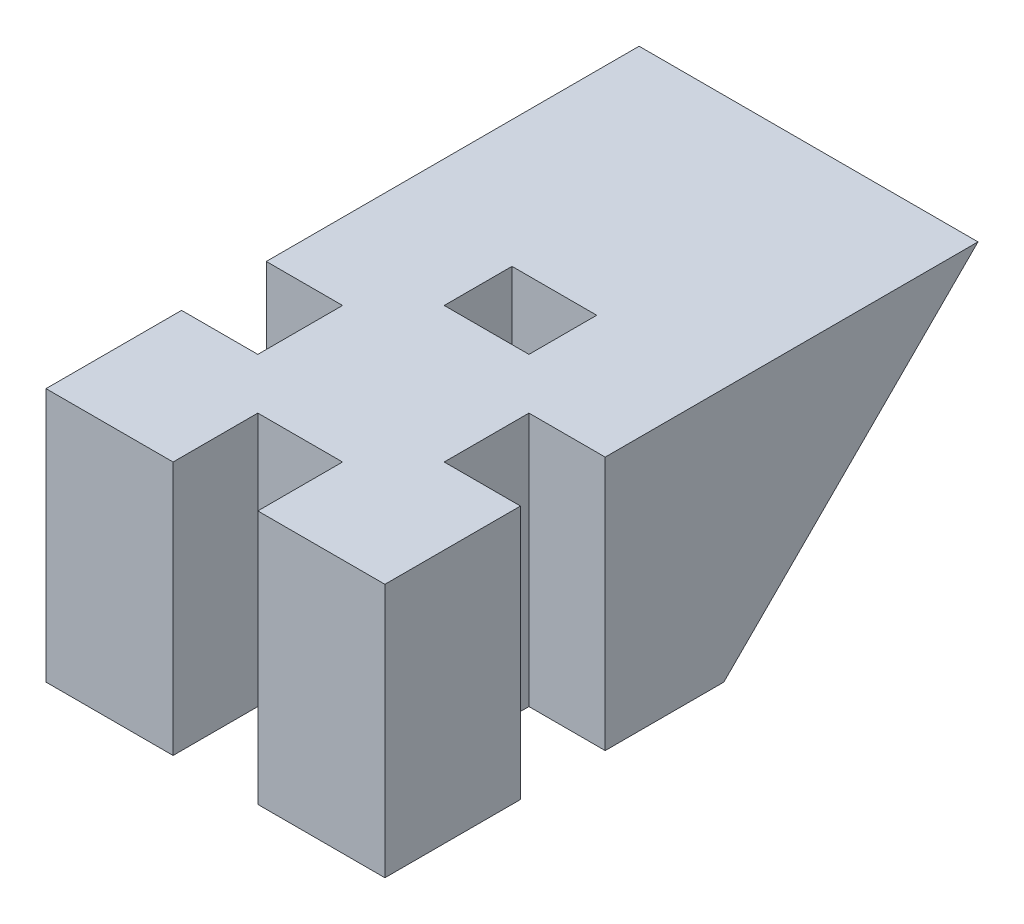
ISO-10303-21;
HEADER;
FILE_DESCRIPTION(('STEP AP214'),'2;1');
FILE_NAME('part.step','',(''),(''),'','','');
FILE_SCHEMA(('AUTOMOTIVE_DESIGN { 1 0 10303 214 1 1 1 1 }'));
ENDSEC;
DATA;
#1=APPLICATION_CONTEXT('core data for automotive mechanical design processes');
#2=APPLICATION_PROTOCOL_DEFINITION('international standard','automotive_design',2000,#1);
#3=PRODUCT_CONTEXT('',#1,'mechanical');
#4=PRODUCT('Part','Part','',(#3));
#5=PRODUCT_RELATED_PRODUCT_CATEGORY('part','',(#4));
#6=PRODUCT_DEFINITION_FORMATION('','',#4);
#7=PRODUCT_DEFINITION_CONTEXT('part definition',#1,'design');
#8=PRODUCT_DEFINITION('design','',#6,#7);
#9=PRODUCT_DEFINITION_SHAPE('','',#8);
#10=(LENGTH_UNIT() NAMED_UNIT(*) SI_UNIT(.MILLI.,.METRE.));
#11=(NAMED_UNIT(*) PLANE_ANGLE_UNIT() SI_UNIT($,.RADIAN.));
#12=(NAMED_UNIT(*) SI_UNIT($,.STERADIAN.) SOLID_ANGLE_UNIT());
#13=UNCERTAINTY_MEASURE_WITH_UNIT(LENGTH_MEASURE(1.E-05),#10,'distance_accuracy_value','');
#14=(GEOMETRIC_REPRESENTATION_CONTEXT(3) GLOBAL_UNCERTAINTY_ASSIGNED_CONTEXT((#13)) GLOBAL_UNIT_ASSIGNED_CONTEXT((#10,
#11,#12)) REPRESENTATION_CONTEXT('',''));
#15=CARTESIAN_POINT('',(0.,0.,0.));
#16=DIRECTION('',(0.,0.,1.));
#17=DIRECTION('',(1.,0.,0.));
#18=AXIS2_PLACEMENT_3D('',#15,#16,#17);
#19=CARTESIAN_POINT('',(10.,40.,-10.));
#20=DIRECTION('',(-1.,0.,0.));
#21=DIRECTION('',(0.,0.,1.));
#22=AXIS2_PLACEMENT_3D('',#19,#20,#21);
#23=PLANE('',#22);
#24=DIRECTION('',(0.,-1.,0.));
#25=VECTOR('',#24,1.);
#26=CARTESIAN_POINT('',(10.,40.,-2.99999999999989));
#27=LINE('',#26,#25);
#28=CARTESIAN_POINT('',(10.,40.,-2.99999999999989));
#29=VERTEX_POINT('',#28);
#30=CARTESIAN_POINT('',(10.,25.,-2.99999999999989));
#31=VERTEX_POINT('',#30);
#32=EDGE_CURVE('E229',#29,#31,#27,.T.);
#33=ORIENTED_EDGE('',*,*,#32,.T.);
#34=DIRECTION('',(0.,0.,-1.));
#35=VECTOR('',#34,1.);
#36=CARTESIAN_POINT('',(10.,25.,-10.));
#37=LINE('',#36,#35);
#38=CARTESIAN_POINT('',(10.,25.,-10.));
#39=VERTEX_POINT('',#38);
#40=EDGE_CURVE('E183',#31,#39,#37,.T.);
#41=ORIENTED_EDGE('',*,*,#40,.T.);
#42=DIRECTION('',(0.,0.707106781186547,-0.707106781186547));
#43=VECTOR('',#42,1.);
#44=CARTESIAN_POINT('',(10.,40.,-25.));
#45=LINE('',#44,#43);
#46=CARTESIAN_POINT('',(10.,40.,-25.));
#47=VERTEX_POINT('',#46);
#48=EDGE_CURVE('E290',#39,#47,#45,.T.);
#49=ORIENTED_EDGE('',*,*,#48,.T.);
#50=DIRECTION('',(0.,0.,-1.));
#51=VECTOR('',#50,1.);
#52=CARTESIAN_POINT('',(10.,40.,-10.));
#53=LINE('',#52,#51);
#54=EDGE_CURVE('E200',#29,#47,#53,.T.);
#55=ORIENTED_EDGE('',*,*,#54,.F.);
#56=EDGE_LOOP('',(#33,#41,#49,#55));
#57=FACE_BOUND('',#56,.T.);
#58=ADVANCED_FACE('F33',(#57),#23,.F.);
#59=CARTESIAN_POINT('',(-10.,40.,-10.));
#60=DIRECTION('',(1.,0.,0.));
#61=DIRECTION('',(0.,0.,-1.));
#62=AXIS2_PLACEMENT_3D('',#59,#60,#61);
#63=PLANE('',#62);
#64=DIRECTION('',(0.,-1.,0.));
#65=VECTOR('',#64,1.);
#66=CARTESIAN_POINT('',(-10.,40.,1.99999999999997));
#67=LINE('',#66,#65);
#68=CARTESIAN_POINT('',(-10.,40.,1.99999999999997));
#69=VERTEX_POINT('',#68);
#70=CARTESIAN_POINT('',(-10.,25.,1.99999999999997));
#71=VERTEX_POINT('',#70);
#72=EDGE_CURVE('E218',#69,#71,#67,.T.);
#73=ORIENTED_EDGE('',*,*,#72,.T.);
#74=DIRECTION('',(0.,0.,-1.));
#75=VECTOR('',#74,1.);
#76=CARTESIAN_POINT('',(-10.,25.,-10.));
#77=LINE('',#76,#75);
#78=CARTESIAN_POINT('',(-10.,25.,10.));
#79=VERTEX_POINT('',#78);
#80=EDGE_CURVE('E325',#79,#71,#77,.T.);
#81=ORIENTED_EDGE('',*,*,#80,.F.);
#82=DIRECTION('',(0.,-1.,0.));
#83=VECTOR('',#82,1.);
#84=CARTESIAN_POINT('',(-10.,40.,10.));
#85=LINE('',#84,#83);
#86=CARTESIAN_POINT('',(-10.,40.,10.));
#87=VERTEX_POINT('',#86);
#88=EDGE_CURVE('E11',#87,#79,#85,.T.);
#89=ORIENTED_EDGE('',*,*,#88,.F.);
#90=DIRECTION('',(0.,0.,1.));
#91=VECTOR('',#90,1.);
#92=CARTESIAN_POINT('',(-10.,40.,-10.));
#93=LINE('',#92,#91);
#94=EDGE_CURVE('E55',#69,#87,#93,.T.);
#95=ORIENTED_EDGE('',*,*,#94,.F.);
#96=EDGE_LOOP('',(#73,#81,#89,#95));
#97=FACE_BOUND('',#96,.T.);
#98=ADVANCED_FACE('F367',(#97),#63,.F.);
#99=CARTESIAN_POINT('',(-10.,40.,10.));
#100=DIRECTION('',(0.,0.,-1.));
#101=DIRECTION('',(-1.,0.,0.));
#102=AXIS2_PLACEMENT_3D('',#99,#100,#101);
#103=PLANE('',#102);
#104=DIRECTION('',(0.,-1.,0.));
#105=VECTOR('',#104,1.);
#106=CARTESIAN_POINT('',(2.5,40.,10.));
#107=LINE('',#106,#105);
#108=CARTESIAN_POINT('',(2.5,40.,10.));
#109=VERTEX_POINT('',#108);
#110=CARTESIAN_POINT('',(2.5,25.,10.));
#111=VERTEX_POINT('',#110);
#112=EDGE_CURVE('E189',#109,#111,#107,.T.);
#113=ORIENTED_EDGE('',*,*,#112,.T.);
#114=DIRECTION('',(-1.,0.,0.));
#115=VECTOR('',#114,1.);
#116=CARTESIAN_POINT('',(10.,25.,10.));
#117=LINE('',#116,#115);
#118=CARTESIAN_POINT('',(10.,25.,10.));
#119=VERTEX_POINT('',#118);
#120=EDGE_CURVE('E175',#119,#111,#117,.T.);
#121=ORIENTED_EDGE('',*,*,#120,.F.);
#122=DIRECTION('',(0.,-1.,0.));
#123=VECTOR('',#122,1.);
#124=CARTESIAN_POINT('',(10.,40.,10.));
#125=LINE('',#124,#123);
#126=CARTESIAN_POINT('',(10.,40.,10.));
#127=VERTEX_POINT('',#126);
#128=EDGE_CURVE('E41',#127,#119,#125,.T.);
#129=ORIENTED_EDGE('',*,*,#128,.F.);
#130=DIRECTION('',(1.,0.,0.));
#131=VECTOR('',#130,1.);
#132=CARTESIAN_POINT('',(-10.,40.,10.));
#133=LINE('',#132,#131);
#134=EDGE_CURVE('E48',#109,#127,#133,.T.);
#135=ORIENTED_EDGE('',*,*,#134,.F.);
#136=EDGE_LOOP('',(#113,#121,#129,#135));
#137=FACE_BOUND('',#136,.T.);
#138=ADVANCED_FACE('F187',(#137),#103,.F.);
#139=ORIENTED_EDGE('',*,*,#128,.T.);
#140=CARTESIAN_POINT('',(10.,25.,2.00000000000011));
#141=VERTEX_POINT('',#140);
#142=EDGE_CURVE('E172',#119,#141,#37,.T.);
#143=ORIENTED_EDGE('',*,*,#142,.T.);
#144=DIRECTION('',(0.,1.,0.));
#145=VECTOR('',#144,1.);
#146=CARTESIAN_POINT('',(10.,40.,2.00000000000011));
#147=LINE('',#146,#145);
#148=CARTESIAN_POINT('',(10.,40.,2.00000000000011));
#149=VERTEX_POINT('',#148);
#150=EDGE_CURVE('E232',#141,#149,#147,.T.);
#151=ORIENTED_EDGE('',*,*,#150,.T.);
#152=EDGE_CURVE('E192',#127,#149,#53,.T.);
#153=ORIENTED_EDGE('',*,*,#152,.F.);
#154=EDGE_LOOP('',(#139,#143,#151,#153));
#155=FACE_BOUND('',#154,.T.);
#156=ADVANCED_FACE('F35',(#155),#23,.F.);
#157=DIRECTION('',(0.,0.707106781186547,-0.707106781186547));
#158=VECTOR('',#157,1.);
#159=CARTESIAN_POINT('',(-10.,40.,-25.));
#160=LINE('',#159,#158);
#161=CARTESIAN_POINT('',(-10.,25.,-10.));
#162=VERTEX_POINT('',#161);
#163=CARTESIAN_POINT('',(-10.,40.,-25.));
#164=VERTEX_POINT('',#163);
#165=EDGE_CURVE('E288',#162,#164,#160,.T.);
#166=ORIENTED_EDGE('',*,*,#165,.F.);
#167=CARTESIAN_POINT('',(-10.,25.,-3.00000000000003));
#168=VERTEX_POINT('',#167);
#169=EDGE_CURVE('E326',#168,#162,#77,.T.);
#170=ORIENTED_EDGE('',*,*,#169,.F.);
#171=DIRECTION('',(0.,1.,0.));
#172=VECTOR('',#171,1.);
#173=CARTESIAN_POINT('',(-10.,40.,-3.00000000000003));
#174=LINE('',#173,#172);
#175=CARTESIAN_POINT('',(-10.,40.,-3.00000000000003));
#176=VERTEX_POINT('',#175);
#177=EDGE_CURVE('E221',#168,#176,#174,.T.);
#178=ORIENTED_EDGE('',*,*,#177,.T.);
#179=EDGE_CURVE('E196',#164,#176,#93,.T.);
#180=ORIENTED_EDGE('',*,*,#179,.F.);
#181=EDGE_LOOP('',(#166,#170,#178,#180));
#182=FACE_BOUND('',#181,.T.);
#183=ADVANCED_FACE('F339',(#182),#63,.F.);
#184=ORIENTED_EDGE('',*,*,#88,.T.);
#185=CARTESIAN_POINT('',(-2.5,25.,10.));
#186=VERTEX_POINT('',#185);
#187=EDGE_CURVE('E182',#186,#79,#117,.T.);
#188=ORIENTED_EDGE('',*,*,#187,.F.);
#189=DIRECTION('',(0.,1.,0.));
#190=VECTOR('',#189,1.);
#191=CARTESIAN_POINT('',(-2.5,40.,10.));
#192=LINE('',#191,#190);
#193=CARTESIAN_POINT('',(-2.5,40.,10.));
#194=VERTEX_POINT('',#193);
#195=EDGE_CURVE('E202',#186,#194,#192,.T.);
#196=ORIENTED_EDGE('',*,*,#195,.T.);
#197=EDGE_CURVE('E193',#87,#194,#133,.T.);
#198=ORIENTED_EDGE('',*,*,#197,.F.);
#199=EDGE_LOOP('',(#184,#188,#196,#198));
#200=FACE_BOUND('',#199,.T.);
#201=ADVANCED_FACE('F377',(#200),#103,.F.);
#202=CARTESIAN_POINT('',(0.,40.,0.));
#203=DIRECTION('',(0.,1.,0.));
#204=DIRECTION('',(0.,0.,1.));
#205=AXIS2_PLACEMENT_3D('',#202,#203,#204);
#206=PLANE('',#205);
#207=DIRECTION('',(1.,0.,0.));
#208=VECTOR('',#207,1.);
#209=CARTESIAN_POINT('',(10.,40.,-10.));
#210=LINE('',#209,#208);
#211=CARTESIAN_POINT('',(-2.5,40.,-10.));
#212=VERTEX_POINT('',#211);
#213=CARTESIAN_POINT('',(2.5,40.,-10.));
#214=VERTEX_POINT('',#213);
#215=EDGE_CURVE('E279',#212,#214,#210,.T.);
#216=ORIENTED_EDGE('',*,*,#215,.T.);
#217=DIRECTION('',(0.,0.,1.));
#218=VECTOR('',#217,1.);
#219=CARTESIAN_POINT('',(2.5,40.,-16.));
#220=LINE('',#219,#218);
#221=CARTESIAN_POINT('',(2.5,40.,-6.));
#222=VERTEX_POINT('',#221);
#223=EDGE_CURVE('E262',#214,#222,#220,.T.);
#224=ORIENTED_EDGE('',*,*,#223,.T.);
#225=DIRECTION('',(-1.,0.,0.));
#226=VECTOR('',#225,1.);
#227=CARTESIAN_POINT('',(2.5,40.,-6.));
#228=LINE('',#227,#226);
#229=CARTESIAN_POINT('',(-2.5,40.,-6.));
#230=VERTEX_POINT('',#229);
#231=EDGE_CURVE('E256',#222,#230,#228,.T.);
#232=ORIENTED_EDGE('',*,*,#231,.T.);
#233=DIRECTION('',(0.,0.,-1.));
#234=VECTOR('',#233,1.);
#235=CARTESIAN_POINT('',(-2.5,40.,-16.));
#236=LINE('',#235,#234);
#237=EDGE_CURVE('E242',#230,#212,#236,.T.);
#238=ORIENTED_EDGE('',*,*,#237,.T.);
#239=EDGE_LOOP('',(#216,#224,#232,#238));
#240=FACE_BOUND('',#239,.T.);
#241=DIRECTION('',(-1.,0.,0.));
#242=VECTOR('',#241,1.);
#243=CARTESIAN_POINT('',(-15.5,40.,1.99999999999995));
#244=LINE('',#243,#242);
#245=CARTESIAN_POINT('',(-5.50000000000001,40.,1.99999999999998));
#246=VERTEX_POINT('',#245);
#247=EDGE_CURVE('E259',#246,#69,#244,.T.);
#248=ORIENTED_EDGE('',*,*,#247,.T.);
#249=ORIENTED_EDGE('',*,*,#94,.T.);
#250=ORIENTED_EDGE('',*,*,#197,.T.);
#251=DIRECTION('',(0.,0.,-1.));
#252=VECTOR('',#251,1.);
#253=CARTESIAN_POINT('',(-2.5,40.,15.));
#254=LINE('',#253,#252);
#255=CARTESIAN_POINT('',(-2.5,40.,5.));
#256=VERTEX_POINT('',#255);
#257=EDGE_CURVE('E213',#194,#256,#254,.T.);
#258=ORIENTED_EDGE('',*,*,#257,.T.);
#259=DIRECTION('',(1.,0.,0.));
#260=VECTOR('',#259,1.);
#261=CARTESIAN_POINT('',(-2.5,40.,5.));
#262=LINE('',#261,#260);
#263=CARTESIAN_POINT('',(2.5,40.,5.));
#264=VERTEX_POINT('',#263);
#265=EDGE_CURVE('E208',#256,#264,#262,.T.);
#266=ORIENTED_EDGE('',*,*,#265,.T.);
#267=DIRECTION('',(0.,0.,1.));
#268=VECTOR('',#267,1.);
#269=CARTESIAN_POINT('',(2.5,40.,15.));
#270=LINE('',#269,#268);
#271=EDGE_CURVE('E216',#264,#109,#270,.T.);
#272=ORIENTED_EDGE('',*,*,#271,.T.);
#273=ORIENTED_EDGE('',*,*,#134,.T.);
#274=ORIENTED_EDGE('',*,*,#152,.T.);
#275=DIRECTION('',(-1.,0.,0.));
#276=VECTOR('',#275,1.);
#277=CARTESIAN_POINT('',(15.5,40.,2.00000000000016));
#278=LINE('',#277,#276);
#279=CARTESIAN_POINT('',(5.49999999999998,40.,2.00000000000006));
#280=VERTEX_POINT('',#279);
#281=EDGE_CURVE('E245',#149,#280,#278,.T.);
#282=ORIENTED_EDGE('',*,*,#281,.T.);
#283=DIRECTION('',(0.,0.,-1.));
#284=VECTOR('',#283,1.);
#285=CARTESIAN_POINT('',(5.49999999999998,40.,2.00000000000006));
#286=LINE('',#285,#284);
#287=CARTESIAN_POINT('',(5.50000000000003,40.,-2.99999999999994));
#288=VERTEX_POINT('',#287);
#289=EDGE_CURVE('E239',#280,#288,#286,.T.);
#290=ORIENTED_EDGE('',*,*,#289,.T.);
#291=DIRECTION('',(1.,0.,0.));
#292=VECTOR('',#291,1.);
#293=CARTESIAN_POINT('',(15.5,40.,-2.99999999999984));
#294=LINE('',#293,#292);
#295=EDGE_CURVE('E248',#288,#29,#294,.T.);
#296=ORIENTED_EDGE('',*,*,#295,.T.);
#297=ORIENTED_EDGE('',*,*,#54,.T.);
#298=DIRECTION('',(1.,0.,0.));
#299=VECTOR('',#298,1.);
#300=CARTESIAN_POINT('',(10.,40.,-25.));
#301=LINE('',#300,#299);
#302=EDGE_CURVE('E251',#164,#47,#301,.T.);
#303=ORIENTED_EDGE('',*,*,#302,.F.);
#304=ORIENTED_EDGE('',*,*,#179,.T.);
#305=DIRECTION('',(1.,0.,0.));
#306=VECTOR('',#305,1.);
#307=CARTESIAN_POINT('',(-15.5,40.,-3.00000000000005));
#308=LINE('',#307,#306);
#309=CARTESIAN_POINT('',(-5.49999999999999,40.,-3.00000000000002));
#310=VERTEX_POINT('',#309);
#311=EDGE_CURVE('E275',#176,#310,#308,.T.);
#312=ORIENTED_EDGE('',*,*,#311,.T.);
#313=DIRECTION('',(0.,0.,1.));
#314=VECTOR('',#313,1.);
#315=CARTESIAN_POINT('',(-5.49999999999999,40.,-3.00000000000002));
#316=LINE('',#315,#314);
#317=EDGE_CURVE('E270',#310,#246,#316,.T.);
#318=ORIENTED_EDGE('',*,*,#317,.T.);
#319=EDGE_LOOP('',(#248,#249,#250,#258,#266,#272,#273,#274,#282,#290,#296,#297,#303,#304,#312,#318));
#320=FACE_BOUND('',#319,.T.);
#321=ADVANCED_FACE('F343',(#240,#320),#206,.T.);
#322=CARTESIAN_POINT('',(2.5,40.,15.));
#323=DIRECTION('',(1.,0.,0.));
#324=DIRECTION('',(0.,0.,-1.));
#325=AXIS2_PLACEMENT_3D('',#322,#323,#324);
#326=PLANE('',#325);
#327=DIRECTION('',(0.,-1.,0.));
#328=VECTOR('',#327,1.);
#329=CARTESIAN_POINT('',(2.5,40.,5.));
#330=LINE('',#329,#328);
#331=CARTESIAN_POINT('',(2.5,25.,5.));
#332=VERTEX_POINT('',#331);
#333=EDGE_CURVE('E204',#264,#332,#330,.T.);
#334=ORIENTED_EDGE('',*,*,#333,.T.);
#335=DIRECTION('',(0.,0.,1.));
#336=VECTOR('',#335,1.);
#337=CARTESIAN_POINT('',(2.5,25.,15.));
#338=LINE('',#337,#336);
#339=EDGE_CURVE('E291',#332,#111,#338,.T.);
#340=ORIENTED_EDGE('',*,*,#339,.T.);
#341=ORIENTED_EDGE('',*,*,#112,.F.);
#342=ORIENTED_EDGE('',*,*,#271,.F.);
#343=EDGE_LOOP('',(#334,#340,#341,#342));
#344=FACE_BOUND('',#343,.T.);
#345=ADVANCED_FACE('F387',(#344),#326,.F.);
#346=CARTESIAN_POINT('',(-2.5,40.,15.));
#347=DIRECTION('',(-1.,0.,0.));
#348=DIRECTION('',(0.,0.,1.));
#349=AXIS2_PLACEMENT_3D('',#346,#347,#348);
#350=PLANE('',#349);
#351=ORIENTED_EDGE('',*,*,#195,.F.);
#352=DIRECTION('',(0.,0.,-1.));
#353=VECTOR('',#352,1.);
#354=CARTESIAN_POINT('',(-2.5,25.,15.));
#355=LINE('',#354,#353);
#356=CARTESIAN_POINT('',(-2.5,25.,5.));
#357=VERTEX_POINT('',#356);
#358=EDGE_CURVE('E295',#186,#357,#355,.T.);
#359=ORIENTED_EDGE('',*,*,#358,.T.);
#360=DIRECTION('',(0.,-1.,0.));
#361=VECTOR('',#360,1.);
#362=CARTESIAN_POINT('',(-2.5,40.,5.));
#363=LINE('',#362,#361);
#364=EDGE_CURVE('E205',#256,#357,#363,.T.);
#365=ORIENTED_EDGE('',*,*,#364,.F.);
#366=ORIENTED_EDGE('',*,*,#257,.F.);
#367=EDGE_LOOP('',(#351,#359,#365,#366));
#368=FACE_BOUND('',#367,.T.);
#369=ADVANCED_FACE('F505',(#368),#350,.F.);
#370=CARTESIAN_POINT('',(-2.5,40.,5.));
#371=DIRECTION('',(0.,0.,-1.));
#372=DIRECTION('',(-1.,0.,0.));
#373=AXIS2_PLACEMENT_3D('',#370,#371,#372);
#374=PLANE('',#373);
#375=ORIENTED_EDGE('',*,*,#364,.T.);
#376=DIRECTION('',(1.,0.,0.));
#377=VECTOR('',#376,1.);
#378=CARTESIAN_POINT('',(-2.5,25.,5.));
#379=LINE('',#378,#377);
#380=EDGE_CURVE('E298',#357,#332,#379,.T.);
#381=ORIENTED_EDGE('',*,*,#380,.T.);
#382=ORIENTED_EDGE('',*,*,#333,.F.);
#383=ORIENTED_EDGE('',*,*,#265,.F.);
#384=EDGE_LOOP('',(#375,#381,#382,#383));
#385=FACE_BOUND('',#384,.T.);
#386=ADVANCED_FACE('F364',(#385),#374,.F.);
#387=CARTESIAN_POINT('',(15.5,40.,-2.99999999999984));
#388=DIRECTION('',(0.,0.,-1.));
#389=DIRECTION('',(-1.,0.,0.));
#390=AXIS2_PLACEMENT_3D('',#387,#388,#389);
#391=PLANE('',#390);
#392=DIRECTION('',(0.,-1.,0.));
#393=VECTOR('',#392,1.);
#394=CARTESIAN_POINT('',(5.50000000000003,40.,-2.99999999999994));
#395=LINE('',#394,#393);
#396=CARTESIAN_POINT('',(5.50000000000003,25.,-2.99999999999994));
#397=VERTEX_POINT('',#396);
#398=EDGE_CURVE('E238',#288,#397,#395,.T.);
#399=ORIENTED_EDGE('',*,*,#398,.T.);
#400=DIRECTION('',(1.,0.,0.));
#401=VECTOR('',#400,1.);
#402=CARTESIAN_POINT('',(15.5,25.,-2.99999999999984));
#403=LINE('',#402,#401);
#404=EDGE_CURVE('E301',#397,#31,#403,.T.);
#405=ORIENTED_EDGE('',*,*,#404,.T.);
#406=ORIENTED_EDGE('',*,*,#32,.F.);
#407=ORIENTED_EDGE('',*,*,#295,.F.);
#408=EDGE_LOOP('',(#399,#405,#406,#407));
#409=FACE_BOUND('',#408,.T.);
#410=ADVANCED_FACE('F348',(#409),#391,.F.);
#411=CARTESIAN_POINT('',(15.5,40.,2.00000000000016));
#412=DIRECTION('',(0.,0.,1.));
#413=DIRECTION('',(1.,0.,0.));
#414=AXIS2_PLACEMENT_3D('',#411,#412,#413);
#415=PLANE('',#414);
#416=ORIENTED_EDGE('',*,*,#150,.F.);
#417=DIRECTION('',(-1.,0.,0.));
#418=VECTOR('',#417,1.);
#419=CARTESIAN_POINT('',(15.5,25.,2.00000000000016));
#420=LINE('',#419,#418);
#421=CARTESIAN_POINT('',(5.49999999999998,25.,2.00000000000006));
#422=VERTEX_POINT('',#421);
#423=EDGE_CURVE('E178',#141,#422,#420,.T.);
#424=ORIENTED_EDGE('',*,*,#423,.T.);
#425=DIRECTION('',(0.,-1.,0.));
#426=VECTOR('',#425,1.);
#427=CARTESIAN_POINT('',(5.49999999999998,40.,2.00000000000006));
#428=LINE('',#427,#426);
#429=EDGE_CURVE('E235',#280,#422,#428,.T.);
#430=ORIENTED_EDGE('',*,*,#429,.F.);
#431=ORIENTED_EDGE('',*,*,#281,.F.);
#432=EDGE_LOOP('',(#416,#424,#430,#431));
#433=FACE_BOUND('',#432,.T.);
#434=ADVANCED_FACE('F354',(#433),#415,.F.);
#435=CARTESIAN_POINT('',(5.49999999999998,40.,2.00000000000006));
#436=DIRECTION('',(-1.,0.,0.));
#437=DIRECTION('',(0.,0.,1.));
#438=AXIS2_PLACEMENT_3D('',#435,#436,#437);
#439=PLANE('',#438);
#440=ORIENTED_EDGE('',*,*,#429,.T.);
#441=DIRECTION('',(0.,0.,-1.));
#442=VECTOR('',#441,1.);
#443=CARTESIAN_POINT('',(5.49999999999998,25.,2.00000000000006));
#444=LINE('',#443,#442);
#445=EDGE_CURVE('E305',#422,#397,#444,.T.);
#446=ORIENTED_EDGE('',*,*,#445,.T.);
#447=ORIENTED_EDGE('',*,*,#398,.F.);
#448=ORIENTED_EDGE('',*,*,#289,.F.);
#449=EDGE_LOOP('',(#440,#446,#447,#448));
#450=FACE_BOUND('',#449,.T.);
#451=ADVANCED_FACE('F352',(#450),#439,.F.);
#452=CARTESIAN_POINT('',(-2.5,40.,-16.));
#453=DIRECTION('',(-1.,0.,0.));
#454=DIRECTION('',(0.,0.,1.));
#455=AXIS2_PLACEMENT_3D('',#452,#453,#454);
#456=PLANE('',#455);
#457=DIRECTION('',(0.,-1.,0.));
#458=VECTOR('',#457,1.);
#459=CARTESIAN_POINT('',(-2.5,40.,-6.));
#460=LINE('',#459,#458);
#461=CARTESIAN_POINT('',(-2.5,25.,-6.));
#462=VERTEX_POINT('',#461);
#463=EDGE_CURVE('E255',#230,#462,#460,.T.);
#464=ORIENTED_EDGE('',*,*,#463,.T.);
#465=DIRECTION('',(0.,0.,-1.));
#466=VECTOR('',#465,1.);
#467=CARTESIAN_POINT('',(-2.5,25.,-16.));
#468=LINE('',#467,#466);
#469=CARTESIAN_POINT('',(-2.5,25.,-10.));
#470=VERTEX_POINT('',#469);
#471=EDGE_CURVE('E308',#462,#470,#468,.T.);
#472=ORIENTED_EDGE('',*,*,#471,.T.);
#473=DIRECTION('',(0.,-1.,0.));
#474=VECTOR('',#473,1.);
#475=CARTESIAN_POINT('',(-2.5,40.,-10.));
#476=LINE('',#475,#474);
#477=EDGE_CURVE('E223',#212,#470,#476,.T.);
#478=ORIENTED_EDGE('',*,*,#477,.F.);
#479=ORIENTED_EDGE('',*,*,#237,.F.);
#480=EDGE_LOOP('',(#464,#472,#478,#479));
#481=FACE_BOUND('',#480,.T.);
#482=ADVANCED_FACE('F362',(#481),#456,.F.);
#483=CARTESIAN_POINT('',(2.5,40.,-16.));
#484=DIRECTION('',(1.,0.,0.));
#485=DIRECTION('',(0.,0.,-1.));
#486=AXIS2_PLACEMENT_3D('',#483,#484,#485);
#487=PLANE('',#486);
#488=DIRECTION('',(0.,1.,0.));
#489=VECTOR('',#488,1.);
#490=CARTESIAN_POINT('',(2.5,40.,-10.));
#491=LINE('',#490,#489);
#492=CARTESIAN_POINT('',(2.5,25.,-10.));
#493=VERTEX_POINT('',#492);
#494=EDGE_CURVE('E226',#493,#214,#491,.T.);
#495=ORIENTED_EDGE('',*,*,#494,.F.);
#496=DIRECTION('',(0.,0.,1.));
#497=VECTOR('',#496,1.);
#498=CARTESIAN_POINT('',(2.5,25.,-16.));
#499=LINE('',#498,#497);
#500=CARTESIAN_POINT('',(2.5,25.,-6.));
#501=VERTEX_POINT('',#500);
#502=EDGE_CURVE('E311',#493,#501,#499,.T.);
#503=ORIENTED_EDGE('',*,*,#502,.T.);
#504=DIRECTION('',(0.,-1.,0.));
#505=VECTOR('',#504,1.);
#506=CARTESIAN_POINT('',(2.5,40.,-6.));
#507=LINE('',#506,#505);
#508=EDGE_CURVE('E252',#222,#501,#507,.T.);
#509=ORIENTED_EDGE('',*,*,#508,.F.);
#510=ORIENTED_EDGE('',*,*,#223,.F.);
#511=EDGE_LOOP('',(#495,#503,#509,#510));
#512=FACE_BOUND('',#511,.T.);
#513=ADVANCED_FACE('F414',(#512),#487,.F.);
#514=CARTESIAN_POINT('',(2.5,40.,-6.));
#515=DIRECTION('',(0.,0.,1.));
#516=DIRECTION('',(1.,0.,0.));
#517=AXIS2_PLACEMENT_3D('',#514,#515,#516);
#518=PLANE('',#517);
#519=ORIENTED_EDGE('',*,*,#508,.T.);
#520=DIRECTION('',(-1.,0.,0.));
#521=VECTOR('',#520,1.);
#522=CARTESIAN_POINT('',(2.5,25.,-6.));
#523=LINE('',#522,#521);
#524=EDGE_CURVE('E314',#501,#462,#523,.T.);
#525=ORIENTED_EDGE('',*,*,#524,.T.);
#526=ORIENTED_EDGE('',*,*,#463,.F.);
#527=ORIENTED_EDGE('',*,*,#231,.F.);
#528=EDGE_LOOP('',(#519,#525,#526,#527));
#529=FACE_BOUND('',#528,.T.);
#530=ADVANCED_FACE('F408',(#529),#518,.F.);
#531=CARTESIAN_POINT('',(-15.5,40.,1.99999999999995));
#532=DIRECTION('',(0.,0.,1.));
#533=DIRECTION('',(1.,0.,0.));
#534=AXIS2_PLACEMENT_3D('',#531,#532,#533);
#535=PLANE('',#534);
#536=DIRECTION('',(0.,-1.,0.));
#537=VECTOR('',#536,1.);
#538=CARTESIAN_POINT('',(-5.50000000000001,40.,1.99999999999998));
#539=LINE('',#538,#537);
#540=CARTESIAN_POINT('',(-5.50000000000001,25.,1.99999999999999));
#541=VERTEX_POINT('',#540);
#542=EDGE_CURVE('E234',#246,#541,#539,.T.);
#543=ORIENTED_EDGE('',*,*,#542,.T.);
#544=DIRECTION('',(-1.,0.,0.));
#545=VECTOR('',#544,1.);
#546=CARTESIAN_POINT('',(-15.5,25.,1.99999999999995));
#547=LINE('',#546,#545);
#548=EDGE_CURVE('E317',#541,#71,#547,.T.);
#549=ORIENTED_EDGE('',*,*,#548,.T.);
#550=ORIENTED_EDGE('',*,*,#72,.F.);
#551=ORIENTED_EDGE('',*,*,#247,.F.);
#552=EDGE_LOOP('',(#543,#549,#550,#551));
#553=FACE_BOUND('',#552,.T.);
#554=ADVANCED_FACE('F394',(#553),#535,.F.);
#555=CARTESIAN_POINT('',(-15.5,40.,-3.00000000000005));
#556=DIRECTION('',(0.,0.,-1.));
#557=DIRECTION('',(-1.,0.,0.));
#558=AXIS2_PLACEMENT_3D('',#555,#556,#557);
#559=PLANE('',#558);
#560=ORIENTED_EDGE('',*,*,#177,.F.);
#561=DIRECTION('',(1.,0.,0.));
#562=VECTOR('',#561,1.);
#563=CARTESIAN_POINT('',(-15.5,25.,-3.00000000000005));
#564=LINE('',#563,#562);
#565=CARTESIAN_POINT('',(-5.49999999999999,25.,-3.00000000000002));
#566=VERTEX_POINT('',#565);
#567=EDGE_CURVE('E320',#168,#566,#564,.T.);
#568=ORIENTED_EDGE('',*,*,#567,.T.);
#569=DIRECTION('',(0.,-1.,0.));
#570=VECTOR('',#569,1.);
#571=CARTESIAN_POINT('',(-5.49999999999999,40.,-3.00000000000002));
#572=LINE('',#571,#570);
#573=EDGE_CURVE('E267',#310,#566,#572,.T.);
#574=ORIENTED_EDGE('',*,*,#573,.F.);
#575=ORIENTED_EDGE('',*,*,#311,.F.);
#576=EDGE_LOOP('',(#560,#568,#574,#575));
#577=FACE_BOUND('',#576,.T.);
#578=ADVANCED_FACE('F399',(#577),#559,.F.);
#579=CARTESIAN_POINT('',(-5.49999999999999,40.,-3.00000000000002));
#580=DIRECTION('',(1.,0.,0.));
#581=DIRECTION('',(0.,0.,-1.));
#582=AXIS2_PLACEMENT_3D('',#579,#580,#581);
#583=PLANE('',#582);
#584=ORIENTED_EDGE('',*,*,#573,.T.);
#585=DIRECTION('',(0.,0.,1.));
#586=VECTOR('',#585,1.);
#587=CARTESIAN_POINT('',(-5.49999999999999,25.,-3.00000000000002));
#588=LINE('',#587,#586);
#589=EDGE_CURVE('E190',#566,#541,#588,.T.);
#590=ORIENTED_EDGE('',*,*,#589,.T.);
#591=ORIENTED_EDGE('',*,*,#542,.F.);
#592=ORIENTED_EDGE('',*,*,#317,.F.);
#593=EDGE_LOOP('',(#584,#590,#591,#592));
#594=FACE_BOUND('',#593,.T.);
#595=ADVANCED_FACE('F397',(#594),#583,.F.);
#596=CARTESIAN_POINT('',(0.,0.,-10.));
#597=DIRECTION('',(0.,0.,-1.));
#598=DIRECTION('',(-1.,0.,0.));
#599=AXIS2_PLACEMENT_3D('',#596,#597,#598);
#600=PLANE('',#599);
#601=ORIENTED_EDGE('',*,*,#215,.F.);
#602=ORIENTED_EDGE('',*,*,#477,.T.);
#603=DIRECTION('',(-1.,0.,0.));
#604=VECTOR('',#603,1.);
#605=CARTESIAN_POINT('',(10.,25.,-10.));
#606=LINE('',#605,#604);
#607=EDGE_CURVE('E285',#493,#470,#606,.T.);
#608=ORIENTED_EDGE('',*,*,#607,.F.);
#609=ORIENTED_EDGE('',*,*,#494,.T.);
#610=EDGE_LOOP('',(#601,#602,#608,#609));
#611=FACE_BOUND('',#610,.T.);
#612=ADVANCED_FACE('F406',(#611),#600,.F.);
#613=CARTESIAN_POINT('',(10.,40.,-25.));
#614=DIRECTION('',(0.,0.707106781186548,0.707106781186548));
#615=DIRECTION('',(0.,-0.707106781186548,0.707106781186548));
#616=AXIS2_PLACEMENT_3D('',#613,#614,#615);
#617=PLANE('',#616);
#618=ORIENTED_EDGE('',*,*,#165,.T.);
#619=ORIENTED_EDGE('',*,*,#302,.T.);
#620=ORIENTED_EDGE('',*,*,#48,.F.);
#621=EDGE_CURVE('E282',#39,#493,#606,.T.);
#622=ORIENTED_EDGE('',*,*,#621,.T.);
#623=ORIENTED_EDGE('',*,*,#607,.T.);
#624=EDGE_CURVE('E286',#470,#162,#606,.T.);
#625=ORIENTED_EDGE('',*,*,#624,.T.);
#626=EDGE_LOOP('',(#618,#619,#620,#622,#623,#625));
#627=FACE_BOUND('',#626,.T.);
#628=ADVANCED_FACE('F336',(#627),#617,.F.);
#629=CARTESIAN_POINT('',(10.,25.,-10.));
#630=DIRECTION('',(0.,1.,0.));
#631=DIRECTION('',(0.,0.,1.));
#632=AXIS2_PLACEMENT_3D('',#629,#630,#631);
#633=PLANE('',#632);
#634=ORIENTED_EDGE('',*,*,#380,.F.);
#635=ORIENTED_EDGE('',*,*,#358,.F.);
#636=ORIENTED_EDGE('',*,*,#187,.T.);
#637=ORIENTED_EDGE('',*,*,#80,.T.);
#638=ORIENTED_EDGE('',*,*,#548,.F.);
#639=ORIENTED_EDGE('',*,*,#589,.F.);
#640=ORIENTED_EDGE('',*,*,#567,.F.);
#641=ORIENTED_EDGE('',*,*,#169,.T.);
#642=ORIENTED_EDGE('',*,*,#624,.F.);
#643=ORIENTED_EDGE('',*,*,#471,.F.);
#644=ORIENTED_EDGE('',*,*,#524,.F.);
#645=ORIENTED_EDGE('',*,*,#502,.F.);
#646=ORIENTED_EDGE('',*,*,#621,.F.);
#647=ORIENTED_EDGE('',*,*,#40,.F.);
#648=ORIENTED_EDGE('',*,*,#404,.F.);
#649=ORIENTED_EDGE('',*,*,#445,.F.);
#650=ORIENTED_EDGE('',*,*,#423,.F.);
#651=ORIENTED_EDGE('',*,*,#142,.F.);
#652=ORIENTED_EDGE('',*,*,#120,.T.);
#653=ORIENTED_EDGE('',*,*,#339,.F.);
#654=EDGE_LOOP('',(#634,#635,#636,#637,#638,#639,#640,#641,#642,#643,#644,#645,#646,#647,#648,
#649,#650,#651,#652,#653));
#655=FACE_BOUND('',#654,.T.);
#656=ADVANCED_FACE('F174',(#655),#633,.F.);
#657=CLOSED_SHELL('',(#58,#98,#138,#156,#183,#201,#321,#345,#369,#386,#410,#434,#451,#482,#513,
#530,#554,#578,#595,#612,#628,#656));
#658=MANIFOLD_SOLID_BREP('B2',#657);
#659=ADVANCED_BREP_SHAPE_REPRESENTATION('',(#18,#658),#14);
#660=SHAPE_DEFINITION_REPRESENTATION(#9,#659);
ENDSEC;
END-ISO-10303-21;
